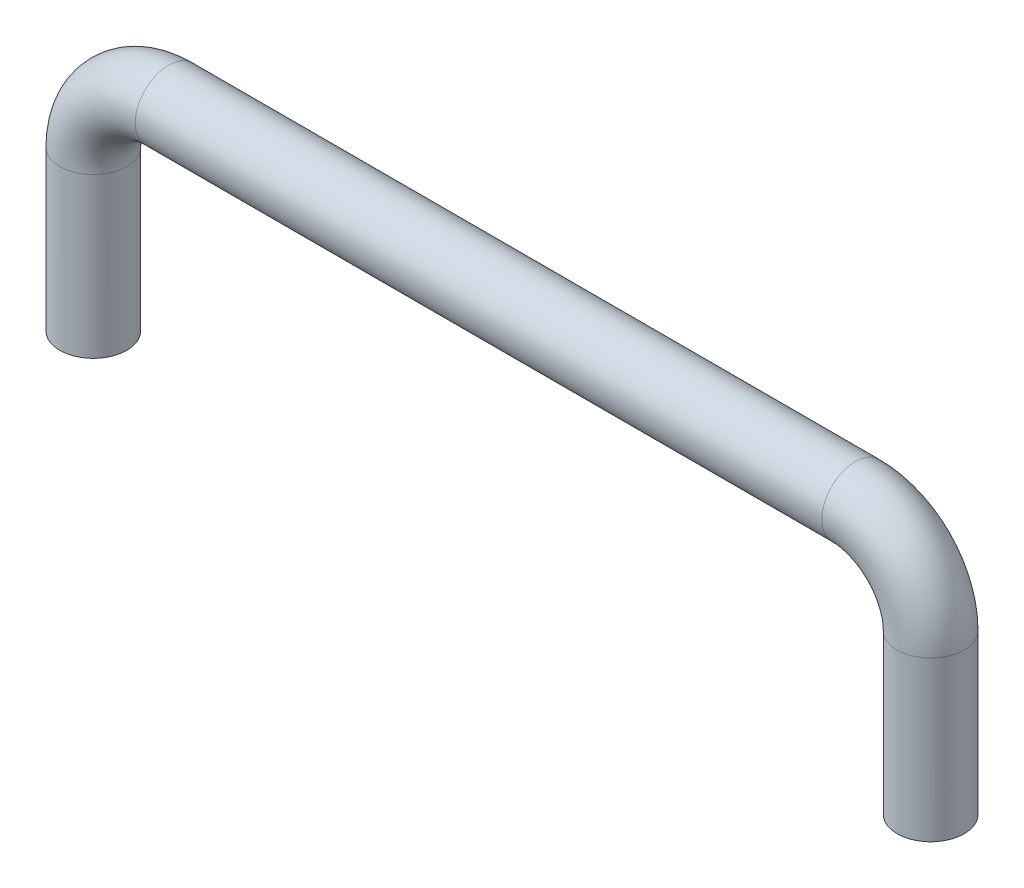
ISO-10303-21;
HEADER;
FILE_DESCRIPTION(('STEP AP214'),'2;1');
FILE_NAME('part.step','',(''),(''),'','','');
FILE_SCHEMA(('AUTOMOTIVE_DESIGN { 1 0 10303 214 1 1 1 1 }'));
ENDSEC;
DATA;
#1=APPLICATION_CONTEXT('core data for automotive mechanical design processes');
#2=APPLICATION_PROTOCOL_DEFINITION('international standard','automotive_design',2000,#1);
#3=PRODUCT_CONTEXT('',#1,'mechanical');
#4=PRODUCT('Part','Part','',(#3));
#5=PRODUCT_RELATED_PRODUCT_CATEGORY('part','',(#4));
#6=PRODUCT_DEFINITION_FORMATION('','',#4);
#7=PRODUCT_DEFINITION_CONTEXT('part definition',#1,'design');
#8=PRODUCT_DEFINITION('design','',#6,#7);
#9=PRODUCT_DEFINITION_SHAPE('','',#8);
#10=(LENGTH_UNIT() NAMED_UNIT(*) SI_UNIT(.MILLI.,.METRE.));
#11=(NAMED_UNIT(*) PLANE_ANGLE_UNIT() SI_UNIT($,.RADIAN.));
#12=(NAMED_UNIT(*) SI_UNIT($,.STERADIAN.) SOLID_ANGLE_UNIT());
#13=UNCERTAINTY_MEASURE_WITH_UNIT(LENGTH_MEASURE(1.E-05),#10,'distance_accuracy_value','');
#14=(GEOMETRIC_REPRESENTATION_CONTEXT(3) GLOBAL_UNCERTAINTY_ASSIGNED_CONTEXT((#13)) GLOBAL_UNIT_ASSIGNED_CONTEXT((#10,
#11,#12)) REPRESENTATION_CONTEXT('',''));
#15=CARTESIAN_POINT('',(0.,0.,0.));
#16=DIRECTION('',(0.,0.,1.));
#17=DIRECTION('',(1.,0.,0.));
#18=AXIS2_PLACEMENT_3D('',#15,#16,#17);
#19=CARTESIAN_POINT('',(100.,19.,0.));
#20=DIRECTION('',(0.,-1.,0.));
#21=DIRECTION('',(0.,0.,-1.));
#22=AXIS2_PLACEMENT_3D('',#19,#20,#21);
#23=CYLINDRICAL_SURFACE('',#22,4.);
#24=CARTESIAN_POINT('',(100.,19.,0.));
#25=DIRECTION('',(0.,-1.,0.));
#26=DIRECTION('',(0.,0.,1.));
#27=AXIS2_PLACEMENT_3D('',#24,#25,#26);
#28=CIRCLE('',#27,4.);
#29=CARTESIAN_POINT('',(104.,19.,0.));
#30=VERTEX_POINT('',#29);
#31=EDGE_CURVE('E43',#30,#30,#28,.T.);
#32=ORIENTED_EDGE('',*,*,#31,.T.);
#33=EDGE_LOOP('',(#32));
#34=FACE_BOUND('',#33,.T.);
#35=CARTESIAN_POINT('',(100.,0.,0.));
#36=DIRECTION('',(0.,-1.,0.));
#37=DIRECTION('',(0.,0.,1.));
#38=AXIS2_PLACEMENT_3D('',#35,#36,#37);
#39=CIRCLE('',#38,4.);
#40=CARTESIAN_POINT('',(100.,0.,4.));
#41=VERTEX_POINT('',#40);
#42=EDGE_CURVE('E10',#41,#41,#39,.T.);
#43=ORIENTED_EDGE('',*,*,#42,.F.);
#44=EDGE_LOOP('',(#43));
#45=FACE_BOUND('',#44,.T.);
#46=ADVANCED_FACE('F37',(#34,#45),#23,.T.);
#47=CARTESIAN_POINT('',(91.,19.,0.));
#48=DIRECTION('',(0.,0.,-1.));
#49=DIRECTION('',(-1.,0.,0.));
#50=AXIS2_PLACEMENT_3D('',#47,#48,#49);
#51=TOROIDAL_SURFACE('',#50,8.99999999999999,4.);
#52=CARTESIAN_POINT('',(91.,28.,0.));
#53=DIRECTION('',(1.,0.,0.));
#54=DIRECTION('',(0.,0.,1.));
#55=AXIS2_PLACEMENT_3D('',#52,#53,#54);
#56=CIRCLE('',#55,4.);
#57=CARTESIAN_POINT('',(91.,32.,0.));
#58=VERTEX_POINT('',#57);
#59=EDGE_CURVE('E47',#58,#58,#56,.T.);
#60=CARTESIAN_POINT('',(91.,19.,0.));
#61=DIRECTION('',(0.,0.,-1.));
#62=DIRECTION('',(-1.,0.,0.));
#63=AXIS2_PLACEMENT_3D('',#60,#61,#62);
#64=CIRCLE('',#63,13.);
#65=EDGE_CURVE('',#58,#30,#64,.T.);
#66=ORIENTED_EDGE('',*,*,#59,.T.);
#67=ORIENTED_EDGE('',*,*,#31,.F.);
#68=ORIENTED_EDGE('',*,*,#65,.T.);
#69=ORIENTED_EDGE('',*,*,#65,.F.);
#70=EDGE_LOOP('',(#66,#68,#67,#69));
#71=FACE_BOUND('',#70,.T.);
#72=ADVANCED_FACE('F81',(#71),#51,.T.);
#73=CARTESIAN_POINT('',(9.,28.,0.));
#74=DIRECTION('',(1.,0.,0.));
#75=DIRECTION('',(0.,0.,-1.));
#76=AXIS2_PLACEMENT_3D('',#73,#74,#75);
#77=CYLINDRICAL_SURFACE('',#76,4.);
#78=CARTESIAN_POINT('',(9.,28.,0.));
#79=DIRECTION('',(1.,0.,0.));
#80=DIRECTION('',(0.,0.,1.));
#81=AXIS2_PLACEMENT_3D('',#78,#79,#80);
#82=CIRCLE('',#81,4.);
#83=CARTESIAN_POINT('',(9.,32.,0.));
#84=VERTEX_POINT('',#83);
#85=EDGE_CURVE('E51',#84,#84,#82,.T.);
#86=ORIENTED_EDGE('',*,*,#85,.T.);
#87=EDGE_LOOP('',(#86));
#88=FACE_BOUND('',#87,.T.);
#89=ORIENTED_EDGE('',*,*,#59,.F.);
#90=EDGE_LOOP('',(#89));
#91=FACE_BOUND('',#90,.T.);
#92=ADVANCED_FACE('F85',(#88,#91),#77,.T.);
#93=CARTESIAN_POINT('',(9.,19.,0.));
#94=DIRECTION('',(0.,0.,-1.));
#95=DIRECTION('',(-1.,0.,0.));
#96=AXIS2_PLACEMENT_3D('',#93,#94,#95);
#97=TOROIDAL_SURFACE('',#96,9.,4.);
#98=CARTESIAN_POINT('',(0.,19.,0.));
#99=DIRECTION('',(0.,1.,0.));
#100=DIRECTION('',(0.,0.,1.));
#101=AXIS2_PLACEMENT_3D('',#98,#99,#100);
#102=CIRCLE('',#101,4.);
#103=CARTESIAN_POINT('',(-4.,19.,0.));
#104=VERTEX_POINT('',#103);
#105=EDGE_CURVE('E56',#104,#104,#102,.T.);
#106=CARTESIAN_POINT('',(9.,19.,0.));
#107=DIRECTION('',(0.,0.,-1.));
#108=DIRECTION('',(-1.,0.,0.));
#109=AXIS2_PLACEMENT_3D('',#106,#107,#108);
#110=CIRCLE('',#109,13.);
#111=EDGE_CURVE('',#104,#84,#110,.T.);
#112=ORIENTED_EDGE('',*,*,#105,.T.);
#113=ORIENTED_EDGE('',*,*,#85,.F.);
#114=ORIENTED_EDGE('',*,*,#111,.T.);
#115=ORIENTED_EDGE('',*,*,#111,.F.);
#116=EDGE_LOOP('',(#112,#114,#113,#115));
#117=FACE_BOUND('',#116,.T.);
#118=ADVANCED_FACE('F63',(#117),#97,.T.);
#119=CARTESIAN_POINT('',(0.,19.,0.));
#120=DIRECTION('',(0.,-1.,0.));
#121=DIRECTION('',(0.,0.,-1.));
#122=AXIS2_PLACEMENT_3D('',#119,#120,#121);
#123=CYLINDRICAL_SURFACE('',#122,4.);
#124=ORIENTED_EDGE('',*,*,#105,.F.);
#125=EDGE_LOOP('',(#124));
#126=FACE_BOUND('',#125,.T.);
#127=CARTESIAN_POINT('',(0.,0.,0.));
#128=DIRECTION('',(0.,1.,0.));
#129=DIRECTION('',(0.,0.,1.));
#130=AXIS2_PLACEMENT_3D('',#127,#128,#129);
#131=CIRCLE('',#130,4.);
#132=CARTESIAN_POINT('',(0.,0.,4.));
#133=VERTEX_POINT('',#132);
#134=EDGE_CURVE('E57',#133,#133,#131,.T.);
#135=ORIENTED_EDGE('',*,*,#134,.T.);
#136=EDGE_LOOP('',(#135));
#137=FACE_BOUND('',#136,.T.);
#138=ADVANCED_FACE('F66',(#126,#137),#123,.T.);
#139=CARTESIAN_POINT('',(100.,0.,0.));
#140=DIRECTION('',(0.,-1.,0.));
#141=DIRECTION('',(0.,0.,1.));
#142=AXIS2_PLACEMENT_3D('',#139,#140,#141);
#143=PLANE('',#142);
#144=ORIENTED_EDGE('',*,*,#42,.T.);
#145=EDGE_LOOP('',(#144));
#146=FACE_BOUND('',#145,.T.);
#147=ADVANCED_FACE('F69',(#146),#143,.T.);
#148=CARTESIAN_POINT('',(0.,0.,0.));
#149=DIRECTION('',(0.,1.,0.));
#150=DIRECTION('',(0.,0.,1.));
#151=AXIS2_PLACEMENT_3D('',#148,#149,#150);
#152=PLANE('',#151);
#153=ORIENTED_EDGE('',*,*,#134,.F.);
#154=EDGE_LOOP('',(#153));
#155=FACE_BOUND('',#154,.T.);
#156=ADVANCED_FACE('F73',(#155),#152,.F.);
#157=CLOSED_SHELL('',(#46,#72,#92,#118,#138,#147,#156));
#158=MANIFOLD_SOLID_BREP('B2',#157);
#159=ADVANCED_BREP_SHAPE_REPRESENTATION('',(#18,#158),#14);
#160=SHAPE_DEFINITION_REPRESENTATION(#9,#159);
ENDSEC;
END-ISO-10303-21;
